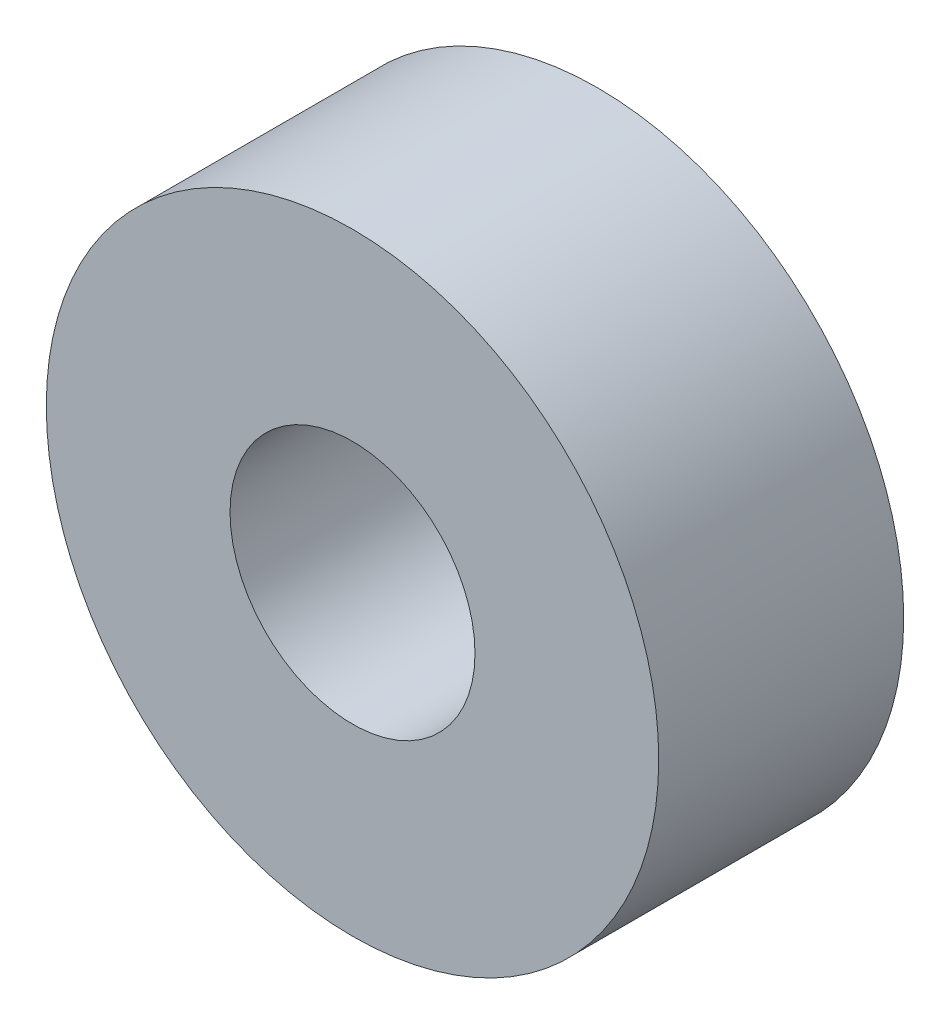
ISO-10303-21;
HEADER;
FILE_DESCRIPTION(('STEP AP214'),'2;1');
FILE_NAME('part.step','',(''),(''),'','','');
FILE_SCHEMA(('AUTOMOTIVE_DESIGN { 1 0 10303 214 1 1 1 1 }'));
ENDSEC;
DATA;
#1=APPLICATION_CONTEXT('core data for automotive mechanical design processes');
#2=APPLICATION_PROTOCOL_DEFINITION('international standard','automotive_design',2000,#1);
#3=PRODUCT_CONTEXT('',#1,'mechanical');
#4=PRODUCT('Part','Part','',(#3));
#5=PRODUCT_RELATED_PRODUCT_CATEGORY('part','',(#4));
#6=PRODUCT_DEFINITION_FORMATION('','',#4);
#7=PRODUCT_DEFINITION_CONTEXT('part definition',#1,'design');
#8=PRODUCT_DEFINITION('design','',#6,#7);
#9=PRODUCT_DEFINITION_SHAPE('','',#8);
#10=(LENGTH_UNIT() NAMED_UNIT(*) SI_UNIT(.MILLI.,.METRE.));
#11=(NAMED_UNIT(*) PLANE_ANGLE_UNIT() SI_UNIT($,.RADIAN.));
#12=(NAMED_UNIT(*) SI_UNIT($,.STERADIAN.) SOLID_ANGLE_UNIT());
#13=UNCERTAINTY_MEASURE_WITH_UNIT(LENGTH_MEASURE(1.E-05),#10,'distance_accuracy_value','');
#14=(GEOMETRIC_REPRESENTATION_CONTEXT(3) GLOBAL_UNCERTAINTY_ASSIGNED_CONTEXT((#13)) GLOBAL_UNIT_ASSIGNED_CONTEXT((#10,
#11,#12)) REPRESENTATION_CONTEXT('',''));
#15=CARTESIAN_POINT('',(0.,0.,0.));
#16=DIRECTION('',(0.,0.,1.));
#17=DIRECTION('',(1.,0.,0.));
#18=AXIS2_PLACEMENT_3D('',#15,#16,#17);
#19=CARTESIAN_POINT('',(0.,0.,6.35));
#20=DIRECTION('',(0.,0.,-1.));
#21=DIRECTION('',(-1.,0.,0.));
#22=AXIS2_PLACEMENT_3D('',#19,#20,#21);
#23=CYLINDRICAL_SURFACE('',#22,7.9375);
#24=CARTESIAN_POINT('',(0.,0.,6.35));
#25=DIRECTION('',(0.,0.,1.));
#26=DIRECTION('',(1.,0.,0.));
#27=AXIS2_PLACEMENT_3D('',#24,#25,#26);
#28=CIRCLE('',#27,7.9375);
#29=CARTESIAN_POINT('',(7.9375,0.,6.35));
#30=VERTEX_POINT('',#29);
#31=EDGE_CURVE('E10',#30,#30,#28,.T.);
#32=ORIENTED_EDGE('',*,*,#31,.F.);
#33=EDGE_LOOP('',(#32));
#34=FACE_BOUND('',#33,.T.);
#35=CARTESIAN_POINT('',(0.,0.,0.));
#36=DIRECTION('',(0.,0.,1.));
#37=DIRECTION('',(1.,0.,0.));
#38=AXIS2_PLACEMENT_3D('',#35,#36,#37);
#39=CIRCLE('',#38,7.9375);
#40=CARTESIAN_POINT('',(7.9375,0.,0.));
#41=VERTEX_POINT('',#40);
#42=EDGE_CURVE('E44',#41,#41,#39,.T.);
#43=ORIENTED_EDGE('',*,*,#42,.T.);
#44=EDGE_LOOP('',(#43));
#45=FACE_BOUND('',#44,.T.);
#46=ADVANCED_FACE('F41',(#34,#45),#23,.T.);
#47=CARTESIAN_POINT('',(0.,0.,6.35));
#48=DIRECTION('',(0.,0.,1.));
#49=DIRECTION('',(1.,0.,0.));
#50=AXIS2_PLACEMENT_3D('',#47,#48,#49);
#51=PLANE('',#50);
#52=CARTESIAN_POINT('',(0.,0.,6.35));
#53=DIRECTION('',(0.,0.,1.));
#54=DIRECTION('',(1.,0.,0.));
#55=AXIS2_PLACEMENT_3D('',#52,#53,#54);
#56=CIRCLE('',#55,3.175);
#57=CARTESIAN_POINT('',(3.175,0.,6.35));
#58=VERTEX_POINT('',#57);
#59=EDGE_CURVE('E55',#58,#58,#56,.T.);
#60=ORIENTED_EDGE('',*,*,#59,.F.);
#61=EDGE_LOOP('',(#60));
#62=FACE_BOUND('',#61,.T.);
#63=ORIENTED_EDGE('',*,*,#31,.T.);
#64=EDGE_LOOP('',(#63));
#65=FACE_BOUND('',#64,.T.);
#66=ADVANCED_FACE('F61',(#62,#65),#51,.T.);
#67=CARTESIAN_POINT('',(0.,0.,0.));
#68=DIRECTION('',(0.,0.,1.));
#69=DIRECTION('',(1.,0.,0.));
#70=AXIS2_PLACEMENT_3D('',#67,#68,#69);
#71=PLANE('',#70);
#72=CARTESIAN_POINT('',(0.,0.,0.));
#73=DIRECTION('',(0.,0.,1.));
#74=DIRECTION('',(1.,0.,0.));
#75=AXIS2_PLACEMENT_3D('',#72,#73,#74);
#76=CIRCLE('',#75,3.175);
#77=CARTESIAN_POINT('',(3.175,0.,0.));
#78=VERTEX_POINT('',#77);
#79=EDGE_CURVE('E51',#78,#78,#76,.T.);
#80=ORIENTED_EDGE('',*,*,#79,.T.);
#81=EDGE_LOOP('',(#80));
#82=FACE_BOUND('',#81,.T.);
#83=ORIENTED_EDGE('',*,*,#42,.F.);
#84=EDGE_LOOP('',(#83));
#85=FACE_BOUND('',#84,.T.);
#86=ADVANCED_FACE('F63',(#82,#85),#71,.F.);
#87=CARTESIAN_POINT('',(0.,0.,6.35));
#88=DIRECTION('',(0.,0.,1.));
#89=DIRECTION('',(1.,0.,0.));
#90=AXIS2_PLACEMENT_3D('',#87,#88,#89);
#91=CYLINDRICAL_SURFACE('',#90,3.175);
#92=ORIENTED_EDGE('',*,*,#79,.F.);
#93=EDGE_LOOP('',(#92));
#94=FACE_BOUND('',#93,.T.);
#95=ORIENTED_EDGE('',*,*,#59,.T.);
#96=EDGE_LOOP('',(#95));
#97=FACE_BOUND('',#96,.T.);
#98=ADVANCED_FACE('F59',(#94,#97),#91,.F.);
#99=CLOSED_SHELL('',(#46,#66,#86,#98));
#100=MANIFOLD_SOLID_BREP('B2',#99);
#101=ADVANCED_BREP_SHAPE_REPRESENTATION('',(#18,#100),#14);
#102=SHAPE_DEFINITION_REPRESENTATION(#9,#101);
ENDSEC;
END-ISO-10303-21;
